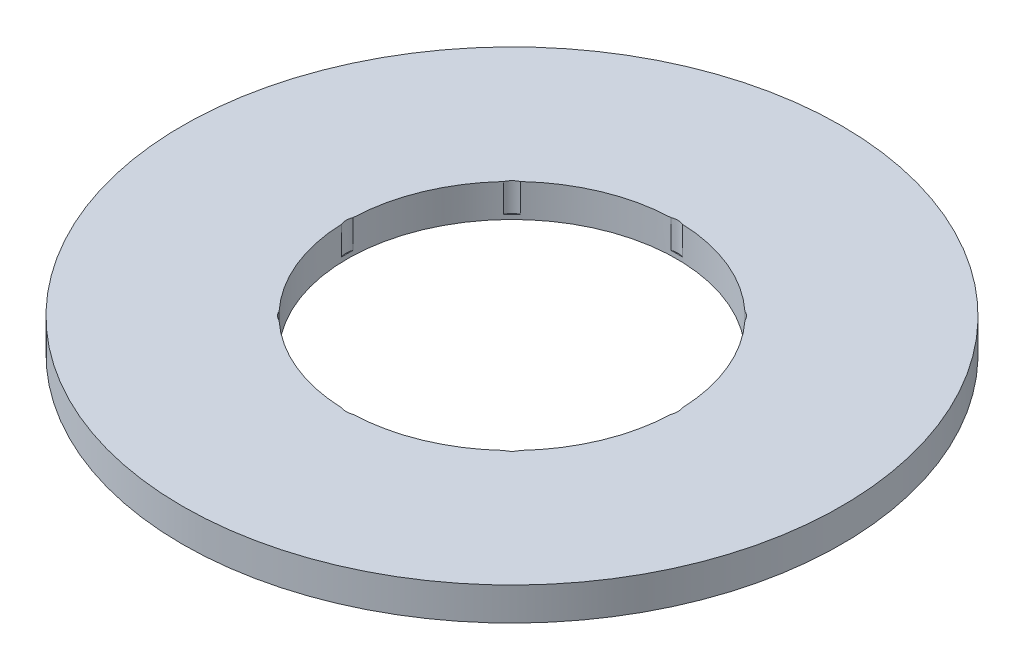
ISO-10303-21;
HEADER;
FILE_DESCRIPTION(('STEP AP214'),'2;1');
FILE_NAME('part.step','',(''),(''),'','','');
FILE_SCHEMA(('AUTOMOTIVE_DESIGN { 1 0 10303 214 1 1 1 1 }'));
ENDSEC;
DATA;
#1=APPLICATION_CONTEXT('core data for automotive mechanical design processes');
#2=APPLICATION_PROTOCOL_DEFINITION('international standard','automotive_design',2000,#1);
#3=PRODUCT_CONTEXT('',#1,'mechanical');
#4=PRODUCT('Part','Part','',(#3));
#5=PRODUCT_RELATED_PRODUCT_CATEGORY('part','',(#4));
#6=PRODUCT_DEFINITION_FORMATION('','',#4);
#7=PRODUCT_DEFINITION_CONTEXT('part definition',#1,'design');
#8=PRODUCT_DEFINITION('design','',#6,#7);
#9=PRODUCT_DEFINITION_SHAPE('','',#8);
#10=(LENGTH_UNIT() NAMED_UNIT(*) SI_UNIT(.MILLI.,.METRE.));
#11=(NAMED_UNIT(*) PLANE_ANGLE_UNIT() SI_UNIT($,.RADIAN.));
#12=(NAMED_UNIT(*) SI_UNIT($,.STERADIAN.) SOLID_ANGLE_UNIT());
#13=UNCERTAINTY_MEASURE_WITH_UNIT(LENGTH_MEASURE(1.E-05),#10,'distance_accuracy_value','');
#14=(GEOMETRIC_REPRESENTATION_CONTEXT(3) GLOBAL_UNCERTAINTY_ASSIGNED_CONTEXT((#13)) GLOBAL_UNIT_ASSIGNED_CONTEXT((#10,
#11,#12)) REPRESENTATION_CONTEXT('',''));
#15=CARTESIAN_POINT('',(0.,0.,0.));
#16=DIRECTION('',(0.,0.,1.));
#17=DIRECTION('',(1.,0.,0.));
#18=AXIS2_PLACEMENT_3D('',#15,#16,#17);
#19=CARTESIAN_POINT('',(0.,10.,0.));
#20=DIRECTION('',(0.,-1.,0.));
#21=DIRECTION('',(0.,0.,-1.));
#22=AXIS2_PLACEMENT_3D('',#19,#20,#21);
#23=CYLINDRICAL_SURFACE('',#22,100.);
#24=CARTESIAN_POINT('',(0.,10.,0.));
#25=DIRECTION('',(0.,1.,0.));
#26=DIRECTION('',(0.,0.,1.));
#27=AXIS2_PLACEMENT_3D('',#24,#25,#26);
#28=CIRCLE('',#27,100.);
#29=CARTESIAN_POINT('',(0.,10.,100.));
#30=VERTEX_POINT('',#29);
#31=EDGE_CURVE('E183',#30,#30,#28,.T.);
#32=ORIENTED_EDGE('',*,*,#31,.F.);
#33=EDGE_LOOP('',(#32));
#34=FACE_BOUND('',#33,.T.);
#35=CARTESIAN_POINT('',(0.,0.,0.));
#36=DIRECTION('',(0.,1.,0.));
#37=DIRECTION('',(0.,0.,1.));
#38=AXIS2_PLACEMENT_3D('',#35,#36,#37);
#39=CIRCLE('',#38,100.);
#40=CARTESIAN_POINT('',(0.,0.,100.));
#41=VERTEX_POINT('',#40);
#42=EDGE_CURVE('E182',#41,#41,#39,.T.);
#43=ORIENTED_EDGE('',*,*,#42,.T.);
#44=EDGE_LOOP('',(#43));
#45=FACE_BOUND('',#44,.T.);
#46=ADVANCED_FACE('F39',(#34,#45),#23,.T.);
#47=CARTESIAN_POINT('',(0.,10.,0.));
#48=DIRECTION('',(0.,1.,0.));
#49=DIRECTION('',(0.,0.,1.));
#50=AXIS2_PLACEMENT_3D('',#47,#48,#49);
#51=PLANE('',#50);
#52=CARTESIAN_POINT('',(1.58460642635219E-13,10.,45.3849318546617));
#53=DIRECTION('',(0.,1.,0.));
#54=DIRECTION('',(1.,0.,0.));
#55=AXIS2_PLACEMENT_3D('',#52,#53,#54);
#56=CIRCLE('',#55,4.92207439500573);
#57=CARTESIAN_POINT('',(-1.79573334380376,10.,49.9677430124471));
#58=VERTEX_POINT('',#57);
#59=CARTESIAN_POINT('',(1.79573334380411,10.,49.967743012447));
#60=VERTEX_POINT('',#59);
#61=EDGE_CURVE('E256',#58,#60,#56,.T.);
#62=ORIENTED_EDGE('',*,*,#61,.F.);
#63=CARTESIAN_POINT('',(0.,10.,0.));
#64=DIRECTION('',(0.,1.,0.));
#65=DIRECTION('',(0.,0.,1.));
#66=AXIS2_PLACEMENT_3D('',#63,#64,#65);
#67=CIRCLE('',#66,50.);
#68=CARTESIAN_POINT('',(-34.0627547000814,10.,36.6023051492947));
#69=VERTEX_POINT('',#68);
#70=EDGE_CURVE('E175',#69,#58,#67,.T.);
#71=ORIENTED_EDGE('',*,*,#70,.F.);
#72=CARTESIAN_POINT('',(-32.0919930781206,10.,32.0919930781207));
#73=DIRECTION('',(0.,1.,0.));
#74=DIRECTION('',(0.707106781186549,0.,0.707106781186546));
#75=AXIS2_PLACEMENT_3D('',#72,#73,#74);
#76=CIRCLE('',#75,4.92207439500573);
#77=CARTESIAN_POINT('',(-36.6023051492945,10.,34.0627547000815));
#78=VERTEX_POINT('',#77);
#79=EDGE_CURVE('E152',#78,#69,#76,.T.);
#80=ORIENTED_EDGE('',*,*,#79,.F.);
#81=CARTESIAN_POINT('',(-49.9677430124471,10.,1.79573334380393));
#82=VERTEX_POINT('',#81);
#83=EDGE_CURVE('E168',#82,#78,#67,.T.);
#84=ORIENTED_EDGE('',*,*,#83,.F.);
#85=CARTESIAN_POINT('',(-45.3849318546617,10.,0.));
#86=DIRECTION('',(0.,1.,0.));
#87=DIRECTION('',(0.,0.,1.));
#88=AXIS2_PLACEMENT_3D('',#85,#86,#87);
#89=CIRCLE('',#88,4.92207439500573);
#90=CARTESIAN_POINT('',(-49.9677430124471,10.,-1.79573334380393));
#91=VERTEX_POINT('',#90);
#92=EDGE_CURVE('E205',#91,#82,#89,.T.);
#93=ORIENTED_EDGE('',*,*,#92,.F.);
#94=CARTESIAN_POINT('',(-36.602305149295,10.,-34.062754700081));
#95=VERTEX_POINT('',#94);
#96=EDGE_CURVE('E181',#95,#91,#67,.T.);
#97=ORIENTED_EDGE('',*,*,#96,.F.);
#98=CARTESIAN_POINT('',(-32.091993078121,10.,-32.0919930781203));
#99=DIRECTION('',(0.,1.,0.));
#100=DIRECTION('',(-0.707106781186539,0.,0.707106781186556));
#101=AXIS2_PLACEMENT_3D('',#98,#99,#100);
#102=CIRCLE('',#101,4.92207439500573);
#103=CARTESIAN_POINT('',(-34.0627547000819,10.,-36.6023051492942));
#104=VERTEX_POINT('',#103);
#105=EDGE_CURVE('E453',#104,#95,#102,.T.);
#106=ORIENTED_EDGE('',*,*,#105,.F.);
#107=CARTESIAN_POINT('',(-1.79573334380446,10.,-49.967743012447));
#108=VERTEX_POINT('',#107);
#109=EDGE_CURVE('E189',#108,#104,#67,.T.);
#110=ORIENTED_EDGE('',*,*,#109,.F.);
#111=CARTESIAN_POINT('',(-4.75381927905656E-13,10.,-45.3849318546617));
#112=DIRECTION('',(0.,1.,0.));
#113=DIRECTION('',(-1.,0.,0.));
#114=AXIS2_PLACEMENT_3D('',#111,#112,#113);
#115=CIRCLE('',#114,4.92207439500573);
#116=CARTESIAN_POINT('',(1.79573334380341,10.,-49.9677430124471));
#117=VERTEX_POINT('',#116);
#118=EDGE_CURVE('E462',#117,#108,#115,.T.);
#119=ORIENTED_EDGE('',*,*,#118,.F.);
#120=CARTESIAN_POINT('',(34.0627547000812,10.,-36.6023051492949));
#121=VERTEX_POINT('',#120);
#122=EDGE_CURVE('E197',#121,#117,#67,.T.);
#123=ORIENTED_EDGE('',*,*,#122,.F.);
#124=CARTESIAN_POINT('',(32.0919930781204,10.,-32.0919930781209));
#125=DIRECTION('',(0.,1.,0.));
#126=DIRECTION('',(-0.707106781186554,0.,-0.707106781186541));
#127=AXIS2_PLACEMENT_3D('',#124,#125,#126);
#128=CIRCLE('',#127,4.92207439500573);
#129=CARTESIAN_POINT('',(36.6023051492943,10.,-34.0627547000818));
#130=VERTEX_POINT('',#129);
#131=EDGE_CURVE('E470',#130,#121,#128,.T.);
#132=ORIENTED_EDGE('',*,*,#131,.F.);
#133=CARTESIAN_POINT('',(49.9677430124471,10.,-1.79573334380393));
#134=VERTEX_POINT('',#133);
#135=EDGE_CURVE('E489',#134,#130,#67,.T.);
#136=ORIENTED_EDGE('',*,*,#135,.F.);
#137=CARTESIAN_POINT('',(45.3849318546617,10.,0.));
#138=DIRECTION('',(0.,1.,0.));
#139=DIRECTION('',(0.,0.,-1.));
#140=AXIS2_PLACEMENT_3D('',#137,#138,#139);
#141=CIRCLE('',#140,4.92207439500573);
#142=CARTESIAN_POINT('',(49.9677430124471,10.,1.79573334380393));
#143=VERTEX_POINT('',#142);
#144=EDGE_CURVE('E476',#143,#134,#141,.T.);
#145=ORIENTED_EDGE('',*,*,#144,.F.);
#146=CARTESIAN_POINT('',(36.6023051492948,10.,34.0627547000813));
#147=VERTEX_POINT('',#146);
#148=EDGE_CURVE('E491',#147,#143,#67,.T.);
#149=ORIENTED_EDGE('',*,*,#148,.F.);
#150=CARTESIAN_POINT('',(32.0919930781208,10.,32.0919930781205));
#151=DIRECTION('',(0.,1.,0.));
#152=DIRECTION('',(0.707106781186544,0.,-0.707106781186551));
#153=AXIS2_PLACEMENT_3D('',#150,#151,#152);
#154=CIRCLE('',#153,4.92207439500573);
#155=CARTESIAN_POINT('',(34.0627547000817,10.,36.6023051492944));
#156=VERTEX_POINT('',#155);
#157=EDGE_CURVE('E475',#156,#147,#154,.T.);
#158=ORIENTED_EDGE('',*,*,#157,.F.);
#159=EDGE_CURVE('E190',#60,#156,#67,.T.);
#160=ORIENTED_EDGE('',*,*,#159,.F.);
#161=EDGE_LOOP('',(#62,#71,#80,#84,#93,#97,#106,#110,#119,#123,#132,#136,#145,#149,#158,#160));
#162=FACE_BOUND('',#161,.T.);
#163=ORIENTED_EDGE('',*,*,#31,.T.);
#164=EDGE_LOOP('',(#163));
#165=FACE_BOUND('',#164,.T.);
#166=ADVANCED_FACE('F170',(#162,#165),#51,.T.);
#167=CARTESIAN_POINT('',(0.,0.,0.));
#168=DIRECTION('',(0.,1.,0.));
#169=DIRECTION('',(0.,0.,1.));
#170=AXIS2_PLACEMENT_3D('',#167,#168,#169);
#171=PLANE('',#170);
#172=CARTESIAN_POINT('',(0.,0.,0.));
#173=DIRECTION('',(0.,1.,0.));
#174=DIRECTION('',(0.,0.,1.));
#175=AXIS2_PLACEMENT_3D('',#172,#173,#174);
#176=CIRCLE('',#175,50.);
#177=CARTESIAN_POINT('',(0.,0.,50.));
#178=VERTEX_POINT('',#177);
#179=EDGE_CURVE('E191',#178,#178,#176,.T.);
#180=ORIENTED_EDGE('',*,*,#179,.T.);
#181=EDGE_LOOP('',(#180));
#182=FACE_BOUND('',#181,.T.);
#183=ORIENTED_EDGE('',*,*,#42,.F.);
#184=EDGE_LOOP('',(#183));
#185=FACE_BOUND('',#184,.T.);
#186=ADVANCED_FACE('F277',(#182,#185),#171,.F.);
#187=CARTESIAN_POINT('',(0.,10.,0.));
#188=DIRECTION('',(0.,-1.,0.));
#189=DIRECTION('',(0.,0.,-1.));
#190=AXIS2_PLACEMENT_3D('',#187,#188,#189);
#191=CYLINDRICAL_SURFACE('',#190,50.);
#192=DIRECTION('',(0.,1.,0.));
#193=VECTOR('',#192,1.);
#194=CARTESIAN_POINT('',(-1.7957333438038,5.68653836486435,49.967743012447));
#195=LINE('',#194,#193);
#196=CARTESIAN_POINT('',(-1.79573334380376,1.3730767297287,49.9677430124471));
#197=VERTEX_POINT('',#196);
#198=EDGE_CURVE('E11',#197,#58,#195,.T.);
#199=ORIENTED_EDGE('',*,*,#198,.F.);
#200=CARTESIAN_POINT('',(0.,1.3730767297287,0.));
#201=DIRECTION('',(0.,1.,0.));
#202=DIRECTION('',(0.,0.,1.));
#203=AXIS2_PLACEMENT_3D('',#200,#201,#202);
#204=CIRCLE('',#203,50.);
#205=CARTESIAN_POINT('',(1.79573334380411,1.3730767297287,49.967743012447));
#206=VERTEX_POINT('',#205);
#207=EDGE_CURVE('E251',#197,#206,#204,.T.);
#208=ORIENTED_EDGE('',*,*,#207,.T.);
#209=DIRECTION('',(0.,1.,0.));
#210=VECTOR('',#209,1.);
#211=CARTESIAN_POINT('',(1.79573334380415,5.68653836486435,49.967743012447));
#212=LINE('',#211,#210);
#213=EDGE_CURVE('E46',#60,#206,#212,.F.);
#214=ORIENTED_EDGE('',*,*,#213,.F.);
#215=ORIENTED_EDGE('',*,*,#159,.T.);
#216=DIRECTION('',(0.,1.,0.));
#217=VECTOR('',#216,1.);
#218=CARTESIAN_POINT('',(34.0627547000816,5.68653836486435,36.6023051492944));
#219=LINE('',#218,#217);
#220=CARTESIAN_POINT('',(34.0627547000817,1.3730767297287,36.6023051492944));
#221=VERTEX_POINT('',#220);
#222=EDGE_CURVE('E253',#221,#156,#219,.T.);
#223=ORIENTED_EDGE('',*,*,#222,.F.);
#224=CARTESIAN_POINT('',(0.,1.3730767297287,0.));
#225=DIRECTION('',(0.,1.,0.));
#226=DIRECTION('',(0.,0.,1.));
#227=AXIS2_PLACEMENT_3D('',#224,#225,#226);
#228=CIRCLE('',#227,50.);
#229=CARTESIAN_POINT('',(36.6023051492948,1.3730767297287,34.0627547000813));
#230=VERTEX_POINT('',#229);
#231=EDGE_CURVE('E246',#221,#230,#228,.T.);
#232=ORIENTED_EDGE('',*,*,#231,.T.);
#233=DIRECTION('',(0.,1.,0.));
#234=VECTOR('',#233,1.);
#235=CARTESIAN_POINT('',(36.6023051492948,5.68653836486435,34.0627547000812));
#236=LINE('',#235,#234);
#237=EDGE_CURVE('E248',#147,#230,#236,.F.);
#238=ORIENTED_EDGE('',*,*,#237,.F.);
#239=ORIENTED_EDGE('',*,*,#148,.T.);
#240=DIRECTION('',(0.,1.,0.));
#241=VECTOR('',#240,1.);
#242=CARTESIAN_POINT('',(49.967743012447,5.68653836486435,1.79573334380398));
#243=LINE('',#242,#241);
#244=CARTESIAN_POINT('',(49.9677430124471,1.3730767297287,1.79573334380393));
#245=VERTEX_POINT('',#244);
#246=EDGE_CURVE('E243',#245,#143,#243,.T.);
#247=ORIENTED_EDGE('',*,*,#246,.F.);
#248=CARTESIAN_POINT('',(0.,1.3730767297287,0.));
#249=DIRECTION('',(0.,1.,0.));
#250=DIRECTION('',(0.,0.,1.));
#251=AXIS2_PLACEMENT_3D('',#248,#249,#250);
#252=CIRCLE('',#251,50.);
#253=CARTESIAN_POINT('',(49.9677430124471,1.3730767297287,-1.79573334380393));
#254=VERTEX_POINT('',#253);
#255=EDGE_CURVE('E236',#245,#254,#252,.T.);
#256=ORIENTED_EDGE('',*,*,#255,.T.);
#257=DIRECTION('',(0.,1.,0.));
#258=VECTOR('',#257,1.);
#259=CARTESIAN_POINT('',(49.967743012447,5.68653836486435,-1.79573334380398));
#260=LINE('',#259,#258);
#261=EDGE_CURVE('E241',#134,#254,#260,.F.);
#262=ORIENTED_EDGE('',*,*,#261,.F.);
#263=ORIENTED_EDGE('',*,*,#135,.T.);
#264=DIRECTION('',(0.,1.,0.));
#265=VECTOR('',#264,1.);
#266=CARTESIAN_POINT('',(36.6023051492943,5.68653836486435,-34.0627547000818));
#267=LINE('',#266,#265);
#268=CARTESIAN_POINT('',(36.6023051492943,1.3730767297287,-34.0627547000818));
#269=VERTEX_POINT('',#268);
#270=EDGE_CURVE('E237',#269,#130,#267,.T.);
#271=ORIENTED_EDGE('',*,*,#270,.F.);
#272=CARTESIAN_POINT('',(0.,1.3730767297287,0.));
#273=DIRECTION('',(0.,1.,0.));
#274=DIRECTION('',(0.,0.,1.));
#275=AXIS2_PLACEMENT_3D('',#272,#273,#274);
#276=CIRCLE('',#275,50.);
#277=CARTESIAN_POINT('',(34.0627547000812,1.3730767297287,-36.6023051492949));
#278=VERTEX_POINT('',#277);
#279=EDGE_CURVE('E229',#269,#278,#276,.T.);
#280=ORIENTED_EDGE('',*,*,#279,.T.);
#281=DIRECTION('',(0.,1.,0.));
#282=VECTOR('',#281,1.);
#283=CARTESIAN_POINT('',(34.0627547000811,5.68653836486435,-36.6023051492949));
#284=LINE('',#283,#282);
#285=EDGE_CURVE('E232',#121,#278,#284,.F.);
#286=ORIENTED_EDGE('',*,*,#285,.F.);
#287=ORIENTED_EDGE('',*,*,#122,.T.);
#288=DIRECTION('',(0.,1.,0.));
#289=VECTOR('',#288,1.);
#290=CARTESIAN_POINT('',(1.79573334380345,5.68653836486435,-49.9677430124471));
#291=LINE('',#290,#289);
#292=CARTESIAN_POINT('',(1.79573334380341,1.3730767297287,-49.9677430124471));
#293=VERTEX_POINT('',#292);
#294=EDGE_CURVE('E227',#293,#117,#291,.T.);
#295=ORIENTED_EDGE('',*,*,#294,.F.);
#296=CARTESIAN_POINT('',(0.,1.3730767297287,0.));
#297=DIRECTION('',(0.,1.,0.));
#298=DIRECTION('',(0.,0.,1.));
#299=AXIS2_PLACEMENT_3D('',#296,#297,#298);
#300=CIRCLE('',#299,50.);
#301=CARTESIAN_POINT('',(-1.79573334380446,1.3730767297287,-49.967743012447));
#302=VERTEX_POINT('',#301);
#303=EDGE_CURVE('E225',#293,#302,#300,.T.);
#304=ORIENTED_EDGE('',*,*,#303,.T.);
#305=DIRECTION('',(0.,1.,0.));
#306=VECTOR('',#305,1.);
#307=CARTESIAN_POINT('',(-1.7957333438045,5.68653836486435,-49.967743012447));
#308=LINE('',#307,#306);
#309=EDGE_CURVE('E223',#108,#302,#308,.F.);
#310=ORIENTED_EDGE('',*,*,#309,.F.);
#311=ORIENTED_EDGE('',*,*,#109,.T.);
#312=DIRECTION('',(0.,1.,0.));
#313=VECTOR('',#312,1.);
#314=CARTESIAN_POINT('',(-34.0627547000819,5.68653836486435,-36.6023051492942));
#315=LINE('',#314,#313);
#316=CARTESIAN_POINT('',(-34.0627547000819,1.3730767297287,-36.6023051492942));
#317=VERTEX_POINT('',#316);
#318=EDGE_CURVE('E219',#317,#104,#315,.T.);
#319=ORIENTED_EDGE('',*,*,#318,.F.);
#320=CARTESIAN_POINT('',(0.,1.3730767297287,0.));
#321=DIRECTION('',(0.,1.,0.));
#322=DIRECTION('',(0.,0.,1.));
#323=AXIS2_PLACEMENT_3D('',#320,#321,#322);
#324=CIRCLE('',#323,50.);
#325=CARTESIAN_POINT('',(-36.602305149295,1.3730767297287,-34.062754700081));
#326=VERTEX_POINT('',#325);
#327=EDGE_CURVE('E159',#317,#326,#324,.T.);
#328=ORIENTED_EDGE('',*,*,#327,.T.);
#329=DIRECTION('',(0.,1.,0.));
#330=VECTOR('',#329,1.);
#331=CARTESIAN_POINT('',(-36.602305149295,5.68653836486435,-34.062754700081));
#332=LINE('',#331,#330);
#333=EDGE_CURVE('E220',#95,#326,#332,.F.);
#334=ORIENTED_EDGE('',*,*,#333,.F.);
#335=ORIENTED_EDGE('',*,*,#96,.T.);
#336=DIRECTION('',(0.,1.,0.));
#337=VECTOR('',#336,1.);
#338=CARTESIAN_POINT('',(-49.967743012447,5.68653836486435,-1.79573334380398));
#339=LINE('',#338,#337);
#340=CARTESIAN_POINT('',(-49.9677430124471,1.3730767297287,-1.79573334380393));
#341=VERTEX_POINT('',#340);
#342=EDGE_CURVE('E209',#341,#91,#339,.T.);
#343=ORIENTED_EDGE('',*,*,#342,.F.);
#344=CARTESIAN_POINT('',(0.,1.3730767297287,0.));
#345=DIRECTION('',(0.,1.,0.));
#346=DIRECTION('',(0.,0.,1.));
#347=AXIS2_PLACEMENT_3D('',#344,#345,#346);
#348=CIRCLE('',#347,50.);
#349=CARTESIAN_POINT('',(-49.9677430124471,1.3730767297287,1.79573334380393));
#350=VERTEX_POINT('',#349);
#351=EDGE_CURVE('E206',#341,#350,#348,.T.);
#352=ORIENTED_EDGE('',*,*,#351,.T.);
#353=DIRECTION('',(0.,1.,0.));
#354=VECTOR('',#353,1.);
#355=CARTESIAN_POINT('',(-49.967743012447,5.68653836486435,1.79573334380398));
#356=LINE('',#355,#354);
#357=EDGE_CURVE('E179',#82,#350,#356,.F.);
#358=ORIENTED_EDGE('',*,*,#357,.F.);
#359=ORIENTED_EDGE('',*,*,#83,.T.);
#360=DIRECTION('',(0.,1.,0.));
#361=VECTOR('',#360,1.);
#362=CARTESIAN_POINT('',(-36.6023051492946,5.68653836486435,34.0627547000815));
#363=LINE('',#362,#361);
#364=CARTESIAN_POINT('',(-36.6023051492945,1.3730767297287,34.0627547000815));
#365=VERTEX_POINT('',#364);
#366=EDGE_CURVE('E147',#365,#78,#363,.T.);
#367=ORIENTED_EDGE('',*,*,#366,.F.);
#368=CARTESIAN_POINT('',(0.,1.3730767297287,0.));
#369=DIRECTION('',(0.,1.,0.));
#370=DIRECTION('',(0.,0.,1.));
#371=AXIS2_PLACEMENT_3D('',#368,#369,#370);
#372=CIRCLE('',#371,50.);
#373=CARTESIAN_POINT('',(-34.0627547000814,1.3730767297287,36.6023051492947));
#374=VERTEX_POINT('',#373);
#375=EDGE_CURVE('E215',#365,#374,#372,.T.);
#376=ORIENTED_EDGE('',*,*,#375,.T.);
#377=DIRECTION('',(0.,1.,0.));
#378=VECTOR('',#377,1.);
#379=CARTESIAN_POINT('',(-34.0627547000814,5.68653836486435,36.6023051492947));
#380=LINE('',#379,#378);
#381=EDGE_CURVE('E161',#69,#374,#380,.F.);
#382=ORIENTED_EDGE('',*,*,#381,.F.);
#383=ORIENTED_EDGE('',*,*,#70,.T.);
#384=EDGE_LOOP('',(#199,#208,#214,#215,#223,#232,#238,#239,#247,#256,#262,#263,#271,#280,#286,
#287,#295,#304,#310,#311,#319,#328,#334,#335,#343,#352,#358,#359,#367,#376,#382,#383));
#385=FACE_BOUND('',#384,.T.);
#386=ORIENTED_EDGE('',*,*,#179,.F.);
#387=EDGE_LOOP('',(#386));
#388=FACE_BOUND('',#387,.T.);
#389=ADVANCED_FACE('F176',(#385,#388),#191,.F.);
#390=CARTESIAN_POINT('',(-45.3849318546617,1.3730767297287,0.));
#391=DIRECTION('',(0.,1.,0.));
#392=DIRECTION('',(0.,0.,1.));
#393=AXIS2_PLACEMENT_3D('',#390,#391,#392);
#394=CYLINDRICAL_SURFACE('',#393,4.92207439500573);
#395=ORIENTED_EDGE('',*,*,#342,.T.);
#396=ORIENTED_EDGE('',*,*,#92,.T.);
#397=ORIENTED_EDGE('',*,*,#357,.T.);
#398=CARTESIAN_POINT('',(-45.3849318546617,1.3730767297287,0.));
#399=DIRECTION('',(0.,1.,0.));
#400=DIRECTION('',(0.,0.,1.));
#401=AXIS2_PLACEMENT_3D('',#398,#399,#400);
#402=CIRCLE('',#401,4.92207439500573);
#403=EDGE_CURVE('E200',#341,#350,#402,.T.);
#404=ORIENTED_EDGE('',*,*,#403,.F.);
#405=EDGE_LOOP('',(#395,#396,#397,#404));
#406=FACE_BOUND('',#405,.T.);
#407=ADVANCED_FACE('F286',(#406),#394,.F.);
#408=CARTESIAN_POINT('',(-45.3849318546617,1.3730767297287,0.));
#409=DIRECTION('',(0.,1.,0.));
#410=DIRECTION('',(0.,0.,1.));
#411=AXIS2_PLACEMENT_3D('',#408,#409,#410);
#412=PLANE('',#411);
#413=ORIENTED_EDGE('',*,*,#403,.T.);
#414=ORIENTED_EDGE('',*,*,#351,.F.);
#415=EDGE_LOOP('',(#413,#414));
#416=FACE_BOUND('',#415,.T.);
#417=ADVANCED_FACE('F289',(#416),#412,.T.);
#418=CARTESIAN_POINT('',(-32.0919930781206,1.3730767297287,32.0919930781207));
#419=DIRECTION('',(0.,1.,0.));
#420=DIRECTION('',(0.,0.,1.));
#421=AXIS2_PLACEMENT_3D('',#418,#419,#420);
#422=CYLINDRICAL_SURFACE('',#421,4.92207439500573);
#423=ORIENTED_EDGE('',*,*,#366,.T.);
#424=ORIENTED_EDGE('',*,*,#79,.T.);
#425=ORIENTED_EDGE('',*,*,#381,.T.);
#426=CARTESIAN_POINT('',(-32.0919930781206,1.3730767297287,32.0919930781207));
#427=DIRECTION('',(0.,1.,0.));
#428=DIRECTION('',(0.707106781186549,0.,0.707106781186546));
#429=AXIS2_PLACEMENT_3D('',#426,#427,#428);
#430=CIRCLE('',#429,4.92207439500573);
#431=EDGE_CURVE('E156',#365,#374,#430,.T.);
#432=ORIENTED_EDGE('',*,*,#431,.F.);
#433=EDGE_LOOP('',(#423,#424,#425,#432));
#434=FACE_BOUND('',#433,.T.);
#435=ADVANCED_FACE('F155',(#434),#422,.F.);
#436=CARTESIAN_POINT('',(-32.0919930781206,1.3730767297287,32.0919930781207));
#437=DIRECTION('',(0.,1.,0.));
#438=DIRECTION('',(0.707106781186549,0.,0.707106781186546));
#439=AXIS2_PLACEMENT_3D('',#436,#437,#438);
#440=PLANE('',#439);
#441=ORIENTED_EDGE('',*,*,#431,.T.);
#442=ORIENTED_EDGE('',*,*,#375,.F.);
#443=EDGE_LOOP('',(#441,#442));
#444=FACE_BOUND('',#443,.T.);
#445=ADVANCED_FACE('F300',(#444),#440,.T.);
#446=CARTESIAN_POINT('',(-32.091993078121,1.3730767297287,-32.0919930781203));
#447=DIRECTION('',(0.,1.,0.));
#448=DIRECTION('',(0.,0.,1.));
#449=AXIS2_PLACEMENT_3D('',#446,#447,#448);
#450=CYLINDRICAL_SURFACE('',#449,4.92207439500573);
#451=ORIENTED_EDGE('',*,*,#318,.T.);
#452=ORIENTED_EDGE('',*,*,#105,.T.);
#453=ORIENTED_EDGE('',*,*,#333,.T.);
#454=CARTESIAN_POINT('',(-32.091993078121,1.3730767297287,-32.0919930781203));
#455=DIRECTION('',(0.,1.,0.));
#456=DIRECTION('',(-0.707106781186539,0.,0.707106781186556));
#457=AXIS2_PLACEMENT_3D('',#454,#455,#456);
#458=CIRCLE('',#457,4.92207439500573);
#459=EDGE_CURVE('E454',#317,#326,#458,.T.);
#460=ORIENTED_EDGE('',*,*,#459,.F.);
#461=EDGE_LOOP('',(#451,#452,#453,#460));
#462=FACE_BOUND('',#461,.T.);
#463=ADVANCED_FACE('F299',(#462),#450,.F.);
#464=CARTESIAN_POINT('',(-32.091993078121,1.3730767297287,-32.0919930781203));
#465=DIRECTION('',(0.,1.,0.));
#466=DIRECTION('',(-0.707106781186539,0.,0.707106781186556));
#467=AXIS2_PLACEMENT_3D('',#464,#465,#466);
#468=PLANE('',#467);
#469=ORIENTED_EDGE('',*,*,#459,.T.);
#470=ORIENTED_EDGE('',*,*,#327,.F.);
#471=EDGE_LOOP('',(#469,#470));
#472=FACE_BOUND('',#471,.T.);
#473=ADVANCED_FACE('F379',(#472),#468,.T.);
#474=CARTESIAN_POINT('',(-4.75381927905656E-13,1.3730767297287,-45.3849318546617));
#475=DIRECTION('',(0.,1.,0.));
#476=DIRECTION('',(0.,0.,1.));
#477=AXIS2_PLACEMENT_3D('',#474,#475,#476);
#478=CYLINDRICAL_SURFACE('',#477,4.92207439500573);
#479=ORIENTED_EDGE('',*,*,#294,.T.);
#480=ORIENTED_EDGE('',*,*,#118,.T.);
#481=ORIENTED_EDGE('',*,*,#309,.T.);
#482=CARTESIAN_POINT('',(-4.75381927905656E-13,1.3730767297287,-45.3849318546617));
#483=DIRECTION('',(0.,1.,0.));
#484=DIRECTION('',(-1.,0.,0.));
#485=AXIS2_PLACEMENT_3D('',#482,#483,#484);
#486=CIRCLE('',#485,4.92207439500573);
#487=EDGE_CURVE('E465',#293,#302,#486,.T.);
#488=ORIENTED_EDGE('',*,*,#487,.F.);
#489=EDGE_LOOP('',(#479,#480,#481,#488));
#490=FACE_BOUND('',#489,.T.);
#491=ADVANCED_FACE('F371',(#490),#478,.F.);
#492=CARTESIAN_POINT('',(-4.75381927905656E-13,1.3730767297287,-45.3849318546617));
#493=DIRECTION('',(0.,1.,0.));
#494=DIRECTION('',(-1.,0.,0.));
#495=AXIS2_PLACEMENT_3D('',#492,#493,#494);
#496=PLANE('',#495);
#497=ORIENTED_EDGE('',*,*,#487,.T.);
#498=ORIENTED_EDGE('',*,*,#303,.F.);
#499=EDGE_LOOP('',(#497,#498));
#500=FACE_BOUND('',#499,.T.);
#501=ADVANCED_FACE('F308',(#500),#496,.T.);
#502=CARTESIAN_POINT('',(32.0919930781204,1.3730767297287,-32.0919930781209));
#503=DIRECTION('',(0.,1.,0.));
#504=DIRECTION('',(0.,0.,1.));
#505=AXIS2_PLACEMENT_3D('',#502,#503,#504);
#506=CYLINDRICAL_SURFACE('',#505,4.92207439500573);
#507=ORIENTED_EDGE('',*,*,#270,.T.);
#508=ORIENTED_EDGE('',*,*,#131,.T.);
#509=ORIENTED_EDGE('',*,*,#285,.T.);
#510=CARTESIAN_POINT('',(32.0919930781204,1.3730767297287,-32.0919930781209));
#511=DIRECTION('',(0.,1.,0.));
#512=DIRECTION('',(-0.707106781186554,0.,-0.707106781186541));
#513=AXIS2_PLACEMENT_3D('',#510,#511,#512);
#514=CIRCLE('',#513,4.92207439500573);
#515=EDGE_CURVE('E477',#269,#278,#514,.T.);
#516=ORIENTED_EDGE('',*,*,#515,.F.);
#517=EDGE_LOOP('',(#507,#508,#509,#516));
#518=FACE_BOUND('',#517,.T.);
#519=ADVANCED_FACE('F305',(#518),#506,.F.);
#520=CARTESIAN_POINT('',(32.0919930781204,1.3730767297287,-32.0919930781209));
#521=DIRECTION('',(0.,1.,0.));
#522=DIRECTION('',(-0.707106781186554,0.,-0.707106781186541));
#523=AXIS2_PLACEMENT_3D('',#520,#521,#522);
#524=PLANE('',#523);
#525=ORIENTED_EDGE('',*,*,#515,.T.);
#526=ORIENTED_EDGE('',*,*,#279,.F.);
#527=EDGE_LOOP('',(#525,#526));
#528=FACE_BOUND('',#527,.T.);
#529=ADVANCED_FACE('F304',(#528),#524,.T.);
#530=CARTESIAN_POINT('',(45.3849318546617,1.3730767297287,0.));
#531=DIRECTION('',(0.,1.,0.));
#532=DIRECTION('',(0.,0.,1.));
#533=AXIS2_PLACEMENT_3D('',#530,#531,#532);
#534=CYLINDRICAL_SURFACE('',#533,4.92207439500573);
#535=ORIENTED_EDGE('',*,*,#246,.T.);
#536=ORIENTED_EDGE('',*,*,#144,.T.);
#537=ORIENTED_EDGE('',*,*,#261,.T.);
#538=CARTESIAN_POINT('',(45.3849318546617,1.3730767297287,0.));
#539=DIRECTION('',(0.,1.,0.));
#540=DIRECTION('',(0.,0.,-1.));
#541=AXIS2_PLACEMENT_3D('',#538,#539,#540);
#542=CIRCLE('',#541,4.92207439500573);
#543=EDGE_CURVE('E478',#245,#254,#542,.T.);
#544=ORIENTED_EDGE('',*,*,#543,.F.);
#545=EDGE_LOOP('',(#535,#536,#537,#544));
#546=FACE_BOUND('',#545,.T.);
#547=ADVANCED_FACE('F309',(#546),#534,.F.);
#548=CARTESIAN_POINT('',(45.3849318546617,1.3730767297287,0.));
#549=DIRECTION('',(0.,1.,0.));
#550=DIRECTION('',(0.,0.,-1.));
#551=AXIS2_PLACEMENT_3D('',#548,#549,#550);
#552=PLANE('',#551);
#553=ORIENTED_EDGE('',*,*,#543,.T.);
#554=ORIENTED_EDGE('',*,*,#255,.F.);
#555=EDGE_LOOP('',(#553,#554));
#556=FACE_BOUND('',#555,.T.);
#557=ADVANCED_FACE('F314',(#556),#552,.T.);
#558=CARTESIAN_POINT('',(32.0919930781208,1.3730767297287,32.0919930781205));
#559=DIRECTION('',(0.,1.,0.));
#560=DIRECTION('',(0.,0.,1.));
#561=AXIS2_PLACEMENT_3D('',#558,#559,#560);
#562=CYLINDRICAL_SURFACE('',#561,4.92207439500573);
#563=ORIENTED_EDGE('',*,*,#222,.T.);
#564=ORIENTED_EDGE('',*,*,#157,.T.);
#565=ORIENTED_EDGE('',*,*,#237,.T.);
#566=CARTESIAN_POINT('',(32.0919930781208,1.3730767297287,32.0919930781205));
#567=DIRECTION('',(0.,1.,0.));
#568=DIRECTION('',(0.707106781186544,0.,-0.707106781186551));
#569=AXIS2_PLACEMENT_3D('',#566,#567,#568);
#570=CIRCLE('',#569,4.92207439500573);
#571=EDGE_CURVE('E56',#221,#230,#570,.T.);
#572=ORIENTED_EDGE('',*,*,#571,.F.);
#573=EDGE_LOOP('',(#563,#564,#565,#572));
#574=FACE_BOUND('',#573,.T.);
#575=ADVANCED_FACE('F318',(#574),#562,.F.);
#576=CARTESIAN_POINT('',(32.0919930781208,1.3730767297287,32.0919930781205));
#577=DIRECTION('',(0.,1.,0.));
#578=DIRECTION('',(0.707106781186544,0.,-0.707106781186551));
#579=AXIS2_PLACEMENT_3D('',#576,#577,#578);
#580=PLANE('',#579);
#581=ORIENTED_EDGE('',*,*,#571,.T.);
#582=ORIENTED_EDGE('',*,*,#231,.F.);
#583=EDGE_LOOP('',(#581,#582));
#584=FACE_BOUND('',#583,.T.);
#585=ADVANCED_FACE('F270',(#584),#580,.T.);
#586=CARTESIAN_POINT('',(1.58460642635219E-13,1.3730767297287,45.3849318546617));
#587=DIRECTION('',(0.,1.,0.));
#588=DIRECTION('',(0.,0.,1.));
#589=AXIS2_PLACEMENT_3D('',#586,#587,#588);
#590=CYLINDRICAL_SURFACE('',#589,4.92207439500573);
#591=ORIENTED_EDGE('',*,*,#198,.T.);
#592=ORIENTED_EDGE('',*,*,#61,.T.);
#593=ORIENTED_EDGE('',*,*,#213,.T.);
#594=CARTESIAN_POINT('',(1.58460642635219E-13,1.3730767297287,45.3849318546617));
#595=DIRECTION('',(0.,1.,0.));
#596=DIRECTION('',(1.,0.,0.));
#597=AXIS2_PLACEMENT_3D('',#594,#595,#596);
#598=CIRCLE('',#597,4.92207439500573);
#599=EDGE_CURVE('E55',#197,#206,#598,.T.);
#600=ORIENTED_EDGE('',*,*,#599,.F.);
#601=EDGE_LOOP('',(#591,#592,#593,#600));
#602=FACE_BOUND('',#601,.T.);
#603=ADVANCED_FACE('F260',(#602),#590,.F.);
#604=CARTESIAN_POINT('',(1.58460642635219E-13,1.3730767297287,45.3849318546617));
#605=DIRECTION('',(0.,1.,0.));
#606=DIRECTION('',(1.,0.,0.));
#607=AXIS2_PLACEMENT_3D('',#604,#605,#606);
#608=PLANE('',#607);
#609=ORIENTED_EDGE('',*,*,#599,.T.);
#610=ORIENTED_EDGE('',*,*,#207,.F.);
#611=EDGE_LOOP('',(#609,#610));
#612=FACE_BOUND('',#611,.T.);
#613=ADVANCED_FACE('F261',(#612),#608,.T.);
#614=CLOSED_SHELL('',(#46,#166,#186,#389,#407,#417,#435,#445,#463,#473,#491,#501,#519,#529,#547,
#557,#575,#585,#603,#613));
#615=MANIFOLD_SOLID_BREP('B2',#614);
#616=ADVANCED_BREP_SHAPE_REPRESENTATION('',(#18,#615),#14);
#617=SHAPE_DEFINITION_REPRESENTATION(#9,#616);
ENDSEC;
END-ISO-10303-21;
